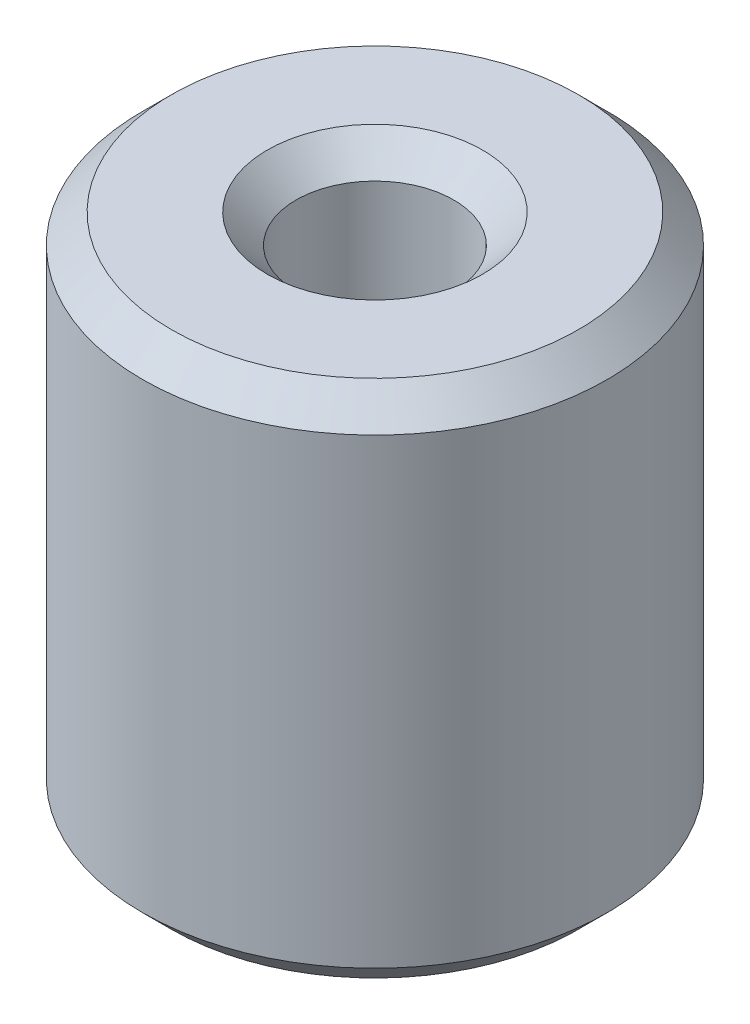
ISO-10303-21;
HEADER;
FILE_DESCRIPTION(('STEP AP214'),'2;1');
FILE_NAME('part.step','',(''),(''),'','','');
FILE_SCHEMA(('AUTOMOTIVE_DESIGN { 1 0 10303 214 1 1 1 1 }'));
ENDSEC;
DATA;
#1=APPLICATION_CONTEXT('core data for automotive mechanical design processes');
#2=APPLICATION_PROTOCOL_DEFINITION('international standard','automotive_design',2000,#1);
#3=PRODUCT_CONTEXT('',#1,'mechanical');
#4=PRODUCT('Part','Part','',(#3));
#5=PRODUCT_RELATED_PRODUCT_CATEGORY('part','',(#4));
#6=PRODUCT_DEFINITION_FORMATION('','',#4);
#7=PRODUCT_DEFINITION_CONTEXT('part definition',#1,'design');
#8=PRODUCT_DEFINITION('design','',#6,#7);
#9=PRODUCT_DEFINITION_SHAPE('','',#8);
#10=(LENGTH_UNIT() NAMED_UNIT(*) SI_UNIT(.MILLI.,.METRE.));
#11=(NAMED_UNIT(*) PLANE_ANGLE_UNIT() SI_UNIT($,.RADIAN.));
#12=(NAMED_UNIT(*) SI_UNIT($,.STERADIAN.) SOLID_ANGLE_UNIT());
#13=UNCERTAINTY_MEASURE_WITH_UNIT(LENGTH_MEASURE(1.E-05),#10,'distance_accuracy_value','');
#14=(GEOMETRIC_REPRESENTATION_CONTEXT(3) GLOBAL_UNCERTAINTY_ASSIGNED_CONTEXT((#13)) GLOBAL_UNIT_ASSIGNED_CONTEXT((#10,
#11,#12)) REPRESENTATION_CONTEXT('',''));
#15=CARTESIAN_POINT('',(0.,0.,0.));
#16=DIRECTION('',(0.,0.,1.));
#17=DIRECTION('',(1.,0.,0.));
#18=AXIS2_PLACEMENT_3D('',#15,#16,#17);
#19=CARTESIAN_POINT('',(0.,11.1764764142794,0.));
#20=DIRECTION('',(0.,-1.,0.));
#21=DIRECTION('',(0.,0.,-1.));
#22=AXIS2_PLACEMENT_3D('',#19,#20,#21);
#23=CYLINDRICAL_SURFACE('',#22,5.);
#24=CARTESIAN_POINT('',(0.,0.620153493718308,0.));
#25=DIRECTION('',(0.,1.,0.));
#26=DIRECTION('',(0.,0.,1.));
#27=AXIS2_PLACEMENT_3D('',#24,#25,#26);
#28=CIRCLE('',#27,5.);
#29=CARTESIAN_POINT('',(0.,0.620153493718308,5.));
#30=VERTEX_POINT('',#29);
#31=EDGE_CURVE('E10',#30,#30,#28,.T.);
#32=ORIENTED_EDGE('',*,*,#31,.T.);
#33=EDGE_LOOP('',(#32));
#34=FACE_BOUND('',#33,.T.);
#35=CARTESIAN_POINT('',(0.,10.5563229205611,0.));
#36=DIRECTION('',(0.,1.,0.));
#37=DIRECTION('',(0.,0.,1.));
#38=AXIS2_PLACEMENT_3D('',#35,#36,#37);
#39=CIRCLE('',#38,5.);
#40=CARTESIAN_POINT('',(0.,10.5563229205611,5.));
#41=VERTEX_POINT('',#40);
#42=EDGE_CURVE('E50',#41,#41,#39,.F.);
#43=ORIENTED_EDGE('',*,*,#42,.T.);
#44=EDGE_LOOP('',(#43));
#45=FACE_BOUND('',#44,.T.);
#46=ADVANCED_FACE('F39',(#34,#45),#23,.T.);
#47=CARTESIAN_POINT('',(0.,11.1764764142794,0.));
#48=DIRECTION('',(0.,1.,0.));
#49=DIRECTION('',(0.,0.,1.));
#50=AXIS2_PLACEMENT_3D('',#47,#48,#49);
#51=PLANE('',#50);
#52=CARTESIAN_POINT('',(0.,11.1764764142794,0.));
#53=DIRECTION('',(0.,1.,0.));
#54=DIRECTION('',(0.,0.,1.));
#55=AXIS2_PLACEMENT_3D('',#52,#53,#54);
#56=CIRCLE('',#55,2.31698149061555);
#57=CARTESIAN_POINT('',(0.,11.1764764142794,2.31698149061555));
#58=VERTEX_POINT('',#57);
#59=EDGE_CURVE('E58',#58,#58,#56,.F.);
#60=ORIENTED_EDGE('',*,*,#59,.T.);
#61=EDGE_LOOP('',(#60));
#62=FACE_BOUND('',#61,.T.);
#63=CARTESIAN_POINT('',(0.,11.1764764142794,0.));
#64=DIRECTION('',(0.,1.,0.));
#65=DIRECTION('',(0.,0.,1.));
#66=AXIS2_PLACEMENT_3D('',#63,#64,#65);
#67=CIRCLE('',#66,4.3798465062817);
#68=CARTESIAN_POINT('',(0.,11.1764764142794,4.3798465062817));
#69=VERTEX_POINT('',#68);
#70=EDGE_CURVE('E61',#69,#69,#67,.T.);
#71=ORIENTED_EDGE('',*,*,#70,.T.);
#72=EDGE_LOOP('',(#71));
#73=FACE_BOUND('',#72,.T.);
#74=ADVANCED_FACE('F88',(#62,#73),#51,.T.);
#75=CARTESIAN_POINT('',(0.,0.,0.));
#76=DIRECTION('',(0.,1.,0.));
#77=DIRECTION('',(0.,0.,1.));
#78=AXIS2_PLACEMENT_3D('',#75,#76,#77);
#79=PLANE('',#78);
#80=CARTESIAN_POINT('',(0.,0.,0.));
#81=DIRECTION('',(0.,1.,0.));
#82=DIRECTION('',(0.,0.,1.));
#83=AXIS2_PLACEMENT_3D('',#80,#81,#82);
#84=CIRCLE('',#83,2.31698149061555);
#85=CARTESIAN_POINT('',(0.,0.,2.31698149061555));
#86=VERTEX_POINT('',#85);
#87=EDGE_CURVE('E51',#86,#86,#84,.T.);
#88=ORIENTED_EDGE('',*,*,#87,.T.);
#89=EDGE_LOOP('',(#88));
#90=FACE_BOUND('',#89,.T.);
#91=CARTESIAN_POINT('',(0.,0.,0.));
#92=DIRECTION('',(0.,1.,0.));
#93=DIRECTION('',(0.,0.,1.));
#94=AXIS2_PLACEMENT_3D('',#91,#92,#93);
#95=CIRCLE('',#94,4.37984650628169);
#96=CARTESIAN_POINT('',(0.,0.,4.37984650628169));
#97=VERTEX_POINT('',#96);
#98=EDGE_CURVE('E54',#97,#97,#95,.F.);
#99=ORIENTED_EDGE('',*,*,#98,.T.);
#100=EDGE_LOOP('',(#99));
#101=FACE_BOUND('',#100,.T.);
#102=ADVANCED_FACE('F83',(#90,#101),#79,.F.);
#103=CARTESIAN_POINT('',(0.,11.1764764142794,0.));
#104=DIRECTION('',(0.,-1.,0.));
#105=DIRECTION('',(0.,0.,-1.));
#106=AXIS2_PLACEMENT_3D('',#103,#104,#105);
#107=CYLINDRICAL_SURFACE('',#106,1.69682799689725);
#108=CARTESIAN_POINT('',(0.,10.5563229205611,0.));
#109=DIRECTION('',(0.,1.,0.));
#110=DIRECTION('',(0.,0.,1.));
#111=AXIS2_PLACEMENT_3D('',#108,#109,#110);
#112=CIRCLE('',#111,1.69682799689725);
#113=CARTESIAN_POINT('',(0.,10.5563229205611,1.69682799689725));
#114=VERTEX_POINT('',#113);
#115=EDGE_CURVE('E67',#114,#114,#112,.T.);
#116=ORIENTED_EDGE('',*,*,#115,.T.);
#117=EDGE_LOOP('',(#116));
#118=FACE_BOUND('',#117,.T.);
#119=CARTESIAN_POINT('',(0.,0.620153493718306,0.));
#120=DIRECTION('',(0.,1.,0.));
#121=DIRECTION('',(0.,0.,1.));
#122=AXIS2_PLACEMENT_3D('',#119,#120,#121);
#123=CIRCLE('',#122,1.69682799689725);
#124=CARTESIAN_POINT('',(0.,0.620153493718306,1.69682799689725));
#125=VERTEX_POINT('',#124);
#126=EDGE_CURVE('E69',#125,#125,#123,.F.);
#127=ORIENTED_EDGE('',*,*,#126,.T.);
#128=EDGE_LOOP('',(#127));
#129=FACE_BOUND('',#128,.T.);
#130=ADVANCED_FACE('F71',(#118,#129),#107,.F.);
#131=CARTESIAN_POINT('',(0.,10.5563229205611,0.));
#132=DIRECTION('',(0.,1.,0.));
#133=DIRECTION('',(0.,0.,1.));
#134=AXIS2_PLACEMENT_3D('',#131,#132,#133);
#135=CONICAL_SURFACE('',#134,1.69682799689725,0.785398163397454);
#136=CARTESIAN_POINT('',(0.,11.1764764142794,2.31698149061555));
#137=CARTESIAN_POINT('',(0.,11.1700164820532,2.31052155838932));
#138=CARTESIAN_POINT('',(0.,11.163556549827,2.30406162616309));
#139=CARTESIAN_POINT('',(0.,11.1506366853745,2.29114176171062));
#140=CARTESIAN_POINT('',(0.,11.1441767531483,2.28468182948439));
#141=CARTESIAN_POINT('',(0.,11.1312568886958,2.27176196503193));
#142=CARTESIAN_POINT('',(0.,11.1247969564696,2.26530203280569));
#143=CARTESIAN_POINT('',(0.,11.1118770920171,2.25238216835323));
#144=CARTESIAN_POINT('',(0.,11.1054171597909,2.245922236127));
#145=CARTESIAN_POINT('',(0.,11.0924972953384,2.23300237167453));
#146=CARTESIAN_POINT('',(0.,11.0860373631122,2.2265424394483));
#147=CARTESIAN_POINT('',(0.,11.0731174986597,2.21362257499584));
#148=CARTESIAN_POINT('',(0.,11.0666575664335,2.2071626427696));
#149=CARTESIAN_POINT('',(0.,11.053737701981,2.19424277831714));
#150=CARTESIAN_POINT('',(0.,11.0472777697548,2.18778284609091));
#151=CARTESIAN_POINT('',(0.,11.0343579053023,2.17486298163844));
#152=CARTESIAN_POINT('',(0.,11.0278979730761,2.16840304941221));
#153=CARTESIAN_POINT('',(0.,11.0149781086236,2.15548318495974));
#154=CARTESIAN_POINT('',(0.,11.0085181763974,2.14902325273351));
#155=CARTESIAN_POINT('',(0.,10.9955983119449,2.13610338828105));
#156=CARTESIAN_POINT('',(0.,10.9891383797187,2.12964345605481));
#157=CARTESIAN_POINT('',(0.,10.9762185152662,2.11672359160235));
#158=CARTESIAN_POINT('',(0.,10.96975858304,2.11026365937612));
#159=CARTESIAN_POINT('',(0.,10.9568387185875,2.09734379492365));
#160=CARTESIAN_POINT('',(0.,10.9503787863613,2.09088386269742));
#161=CARTESIAN_POINT('',(0.,10.9374589219088,2.07796399824496));
#162=CARTESIAN_POINT('',(0.,10.9309989896826,2.07150406601872));
#163=CARTESIAN_POINT('',(0.,10.9180791252302,2.05858420156626));
#164=CARTESIAN_POINT('',(0.,10.9116191930039,2.05212426934003));
#165=CARTESIAN_POINT('',(0.,10.8986993285515,2.03920440488756));
#166=CARTESIAN_POINT('',(0.,10.8922393963252,2.03274447266133));
#167=CARTESIAN_POINT('',(0.,10.8793195318728,2.01982460820887));
#168=CARTESIAN_POINT('',(0.,10.8728595996465,2.01336467598263));
#169=CARTESIAN_POINT('',(0.,10.8599397351941,2.00044481153017));
#170=CARTESIAN_POINT('',(0.,10.8534798029678,1.99398487930394));
#171=CARTESIAN_POINT('',(0.,10.8405599385154,1.98106501485147));
#172=CARTESIAN_POINT('',(0.,10.8341000062891,1.97460508262524));
#173=CARTESIAN_POINT('',(0.,10.8211801418367,1.96168521817277));
#174=CARTESIAN_POINT('',(0.,10.8147202096104,1.95522528594654));
#175=CARTESIAN_POINT('',(0.,10.801800345158,1.94230542149408));
#176=CARTESIAN_POINT('',(0.,10.7953404129317,1.93584548926784));
#177=CARTESIAN_POINT('',(0.,10.7824205484793,1.92292562481538));
#178=CARTESIAN_POINT('',(0.,10.775960616253,1.91646569258915));
#179=CARTESIAN_POINT('',(0.,10.7630407518006,1.90354582813668));
#180=CARTESIAN_POINT('',(0.,10.7565808195743,1.89708589591045));
#181=CARTESIAN_POINT('',(0.,10.7436609551219,1.88416603145799));
#182=CARTESIAN_POINT('',(0.,10.7372010228956,1.87770609923175));
#183=CARTESIAN_POINT('',(0.,10.7242811584432,1.86478623477929));
#184=CARTESIAN_POINT('',(0.,10.7178212262169,1.85832630255306));
#185=CARTESIAN_POINT('',(0.,10.7049013617645,1.84540643810059));
#186=CARTESIAN_POINT('',(0.,10.6984414295383,1.83894650587436));
#187=CARTESIAN_POINT('',(0.,10.6855215650858,1.82602664142189));
#188=CARTESIAN_POINT('',(0.,10.6790616328596,1.81956670919566));
#189=CARTESIAN_POINT('',(0.,10.6661417684071,1.8066468447432));
#190=CARTESIAN_POINT('',(0.,10.6596818361809,1.80018691251697));
#191=CARTESIAN_POINT('',(0.,10.6467619717284,1.7872670480645));
#192=CARTESIAN_POINT('',(0.,10.6403020395022,1.78080711583827));
#193=CARTESIAN_POINT('',(0.,10.6273821750497,1.7678872513858));
#194=CARTESIAN_POINT('',(0.,10.6209222428235,1.76142731915957));
#195=CARTESIAN_POINT('',(0.,10.608002378371,1.74850745470711));
#196=CARTESIAN_POINT('',(0.,10.6015424461448,1.74204752248087));
#197=CARTESIAN_POINT('',(0.,10.5886225816923,1.72912765802841));
#198=CARTESIAN_POINT('',(0.,10.5821626494661,1.72266772580218));
#199=CARTESIAN_POINT('',(0.,10.5692427850136,1.70974786134971));
#200=CARTESIAN_POINT('',(0.,10.5627828527874,1.70328792912348));
#201=CARTESIAN_POINT('',(0.,10.5563229205611,1.69682799689725));
#202=B_SPLINE_CURVE_WITH_KNOTS('',3,(#136,#137,#138,#139,#140,#141,#142,#143,#144,#145,#146,
#147,#148,#149,#150,#151,#152,#153,#154,#155,#156,#157,#158,#159,#160,#161,#162,#163,#164,#165,
#166,#167,#168,#169,#170,#171,#172,#173,#174,#175,#176,#177,#178,#179,#180,#181,#182,#183,#184,
#185,#186,#187,#188,#189,#190,#191,#192,#193,#194,#195,#196,#197,#198,#199,#200,#201),
.UNSPECIFIED.,.F.,.F.,(4,2,2,2,2,2,2,2,2,2,2,2,2,2,2,2,2,2,2,2,2,2,2,2,2,2,2,2,2,2,2,2,4),(0.,
0.0274071712990462,0.0548143425980915,0.0822215138971377,0.109628685196184,0.13703585649523,
0.164443027794277,0.191850199093323,0.219257370392369,0.246664541691416,0.274071712990462,
0.301478884289508,0.328886055588554,0.356293226887601,0.383700398186647,0.411107569485693,
0.43851474078474,0.465921912083786,0.493329083382832,0.520736254681879,0.548143425980925,
0.575550597279971,0.602957768579018,0.630364939878064,0.65777211117711,0.685179282476157,
0.712586453775203,0.739993625074249,0.767400796373296,0.794807967672342,0.822215138971389,
0.849622310270435,0.87702948156948),.UNSPECIFIED.);
#203=EDGE_CURVE('BSEAM77',#58,#114,#202,.T.);
#204=ORIENTED_EDGE('',*,*,#59,.F.);
#205=ORIENTED_EDGE('',*,*,#115,.F.);
#206=ORIENTED_EDGE('',*,*,#203,.T.);
#207=ORIENTED_EDGE('',*,*,#203,.F.);
#208=EDGE_LOOP('',(#204,#206,#205,#207));
#209=FACE_BOUND('',#208,.T.);
#210=ADVANCED_FACE('F77',(#209),#135,.F.);
#211=CARTESIAN_POINT('',(0.,0.,0.));
#212=DIRECTION('',(0.,-1.,0.));
#213=DIRECTION('',(0.,0.,-1.));
#214=AXIS2_PLACEMENT_3D('',#211,#212,#213);
#215=CONICAL_SURFACE('',#214,2.31698149061555,0.785398163397445);
#216=ORIENTED_EDGE('',*,*,#126,.F.);
#217=EDGE_LOOP('',(#216));
#218=FACE_BOUND('',#217,.T.);
#219=ORIENTED_EDGE('',*,*,#87,.F.);
#220=EDGE_LOOP('',(#219));
#221=FACE_BOUND('',#220,.T.);
#222=ADVANCED_FACE('F73',(#218,#221),#215,.F.);
#223=CARTESIAN_POINT('',(0.,0.620153493718308,0.));
#224=DIRECTION('',(0.,1.,0.));
#225=DIRECTION('',(0.,0.,1.));
#226=AXIS2_PLACEMENT_3D('',#223,#224,#225);
#227=CONICAL_SURFACE('',#226,5.,0.785398163397452);
#228=ORIENTED_EDGE('',*,*,#98,.F.);
#229=EDGE_LOOP('',(#228));
#230=FACE_BOUND('',#229,.T.);
#231=ORIENTED_EDGE('',*,*,#31,.F.);
#232=EDGE_LOOP('',(#231));
#233=FACE_BOUND('',#232,.T.);
#234=ADVANCED_FACE('F76',(#230,#233),#227,.T.);
#235=CARTESIAN_POINT('',(0.,11.1764764142794,0.));
#236=DIRECTION('',(0.,-1.,0.));
#237=DIRECTION('',(0.,0.,-1.));
#238=AXIS2_PLACEMENT_3D('',#235,#236,#237);
#239=CONICAL_SURFACE('',#238,4.3798465062817,0.785398163397446);
#240=ORIENTED_EDGE('',*,*,#42,.F.);
#241=EDGE_LOOP('',(#240));
#242=FACE_BOUND('',#241,.T.);
#243=ORIENTED_EDGE('',*,*,#70,.F.);
#244=EDGE_LOOP('',(#243));
#245=FACE_BOUND('',#244,.T.);
#246=ADVANCED_FACE('F45',(#242,#245),#239,.T.);
#247=CLOSED_SHELL('',(#46,#74,#102,#130,#210,#222,#234,#246));
#248=MANIFOLD_SOLID_BREP('B2',#247);
#249=ADVANCED_BREP_SHAPE_REPRESENTATION('',(#18,#248),#14);
#250=SHAPE_DEFINITION_REPRESENTATION(#9,#249);
ENDSEC;
END-ISO-10303-21;
